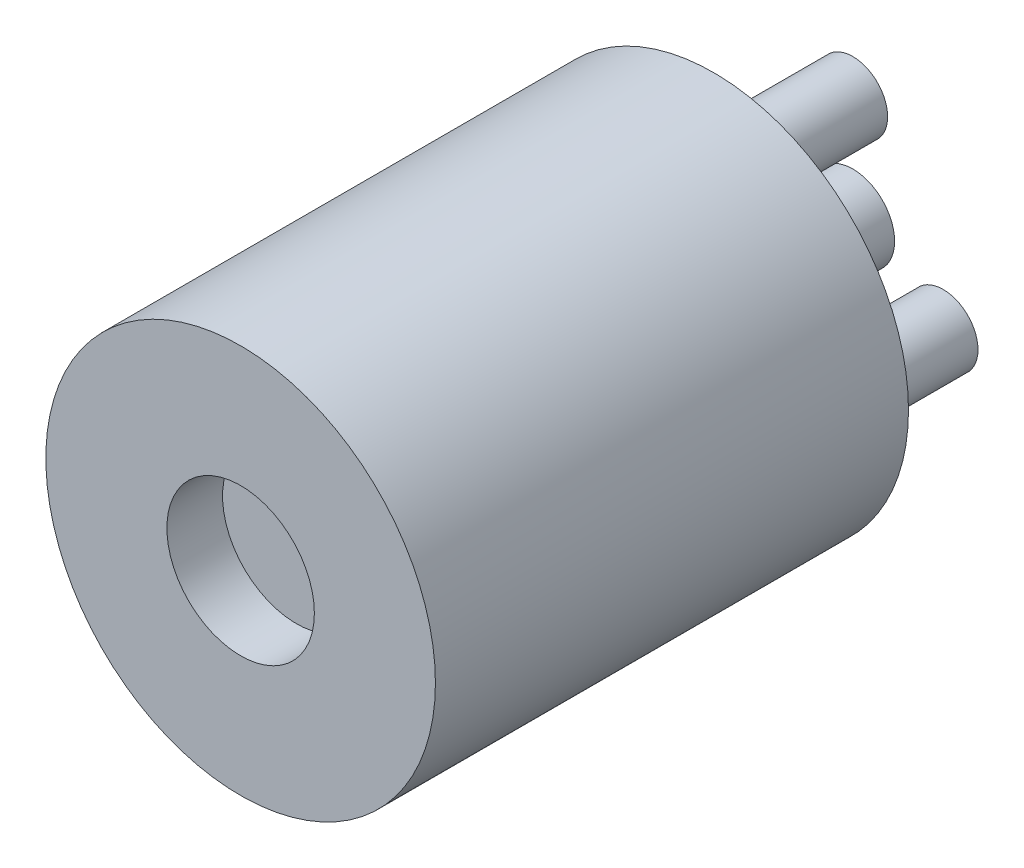
ISO-10303-21;
HEADER;
FILE_DESCRIPTION(('STEP AP214'),'2;1');
FILE_NAME('part.step','',(''),(''),'','','');
FILE_SCHEMA(('AUTOMOTIVE_DESIGN { 1 0 10303 214 1 1 1 1 }'));
ENDSEC;
DATA;
#1=APPLICATION_CONTEXT('core data for automotive mechanical design processes');
#2=APPLICATION_PROTOCOL_DEFINITION('international standard','automotive_design',2000,#1);
#3=PRODUCT_CONTEXT('',#1,'mechanical');
#4=PRODUCT('Part','Part','',(#3));
#5=PRODUCT_RELATED_PRODUCT_CATEGORY('part','',(#4));
#6=PRODUCT_DEFINITION_FORMATION('','',#4);
#7=PRODUCT_DEFINITION_CONTEXT('part definition',#1,'design');
#8=PRODUCT_DEFINITION('design','',#6,#7);
#9=PRODUCT_DEFINITION_SHAPE('','',#8);
#10=(LENGTH_UNIT() NAMED_UNIT(*) SI_UNIT(.MILLI.,.METRE.));
#11=(NAMED_UNIT(*) PLANE_ANGLE_UNIT() SI_UNIT($,.RADIAN.));
#12=(NAMED_UNIT(*) SI_UNIT($,.STERADIAN.) SOLID_ANGLE_UNIT());
#13=UNCERTAINTY_MEASURE_WITH_UNIT(LENGTH_MEASURE(1.E-05),#10,'distance_accuracy_value','');
#14=(GEOMETRIC_REPRESENTATION_CONTEXT(3) GLOBAL_UNCERTAINTY_ASSIGNED_CONTEXT((#13)) GLOBAL_UNIT_ASSIGNED_CONTEXT((#10,
#11,#12)) REPRESENTATION_CONTEXT('',''));
#15=CARTESIAN_POINT('',(0.,0.,0.));
#16=DIRECTION('',(0.,0.,1.));
#17=DIRECTION('',(1.,0.,0.));
#18=AXIS2_PLACEMENT_3D('',#15,#16,#17);
#19=CARTESIAN_POINT('',(-43.4831412322115,-69.9890520639301,17.));
#20=DIRECTION('',(0.,0.,1.));
#21=DIRECTION('',(1.,0.,0.));
#22=AXIS2_PLACEMENT_3D('',#19,#20,#21);
#23=PLANE('',#22);
#24=CARTESIAN_POINT('',(-43.4831412322115,-69.9890520639301,17.));
#25=DIRECTION('',(0.,0.,1.));
#26=DIRECTION('',(1.,0.,0.));
#27=AXIS2_PLACEMENT_3D('',#24,#25,#26);
#28=CIRCLE('',#27,2.65);
#29=CARTESIAN_POINT('',(-40.8331412322115,-69.9890520639301,17.));
#30=VERTEX_POINT('',#29);
#31=EDGE_CURVE('E58',#30,#30,#28,.T.);
#32=ORIENTED_EDGE('',*,*,#31,.F.);
#33=EDGE_LOOP('',(#32));
#34=FACE_BOUND('',#33,.T.);
#35=CARTESIAN_POINT('',(-43.4831412322115,-69.9890520639301,17.));
#36=DIRECTION('',(0.,0.,1.));
#37=DIRECTION('',(1.,0.,0.));
#38=AXIS2_PLACEMENT_3D('',#35,#36,#37);
#39=CIRCLE('',#38,6.9999999999992);
#40=CARTESIAN_POINT('',(-36.4831412322123,-69.9890520639301,17.));
#41=VERTEX_POINT('',#40);
#42=EDGE_CURVE('E45',#41,#41,#39,.T.);
#43=ORIENTED_EDGE('',*,*,#42,.T.);
#44=EDGE_LOOP('',(#43));
#45=FACE_BOUND('',#44,.T.);
#46=ADVANCED_FACE('F37',(#34,#45),#23,.T.);
#47=CARTESIAN_POINT('',(-43.4831412322115,-69.9890520639301,0.));
#48=DIRECTION('',(0.,0.,1.));
#49=DIRECTION('',(1.,0.,0.));
#50=AXIS2_PLACEMENT_3D('',#47,#48,#49);
#51=PLANE('',#50);
#52=CARTESIAN_POINT('',(-43.4831412322115,-69.9890520639301,0.));
#53=DIRECTION('',(0.,0.,1.));
#54=DIRECTION('',(1.,0.,0.));
#55=AXIS2_PLACEMENT_3D('',#52,#53,#54);
#56=CIRCLE('',#55,1.5);
#57=CARTESIAN_POINT('',(-41.9831412322115,-69.9890520639301,0.));
#58=VERTEX_POINT('',#57);
#59=EDGE_CURVE('E10',#58,#58,#56,.F.);
#60=ORIENTED_EDGE('',*,*,#59,.F.);
#61=EDGE_LOOP('',(#60));
#62=FACE_BOUND('',#61,.T.);
#63=CARTESIAN_POINT('',(-43.4831412322115,-69.9890520639301,0.));
#64=DIRECTION('',(0.,0.,1.));
#65=DIRECTION('',(1.,0.,0.));
#66=AXIS2_PLACEMENT_3D('',#63,#64,#65);
#67=CIRCLE('',#66,6.9999999999992);
#68=CARTESIAN_POINT('',(-36.4831412322123,-69.9890520639301,0.));
#69=VERTEX_POINT('',#68);
#70=EDGE_CURVE('E50',#69,#69,#67,.T.);
#71=ORIENTED_EDGE('',*,*,#70,.F.);
#72=EDGE_LOOP('',(#71));
#73=FACE_BOUND('',#72,.T.);
#74=CARTESIAN_POINT('',(-43.4831412322115,-66.2390520639304,0.));
#75=DIRECTION('',(0.,0.,1.));
#76=DIRECTION('',(1.,0.,0.));
#77=AXIS2_PLACEMENT_3D('',#74,#75,#76);
#78=CIRCLE('',#77,1.25);
#79=CARTESIAN_POINT('',(-42.2331412322115,-66.2390520639304,0.));
#80=VERTEX_POINT('',#79);
#81=EDGE_CURVE('E69',#80,#80,#78,.F.);
#82=ORIENTED_EDGE('',*,*,#81,.F.);
#83=EDGE_LOOP('',(#82));
#84=FACE_BOUND('',#83,.T.);
#85=CARTESIAN_POINT('',(-40.2355459680198,-71.8640520639283,0.));
#86=DIRECTION('',(0.,0.,1.));
#87=DIRECTION('',(1.,0.,0.));
#88=AXIS2_PLACEMENT_3D('',#85,#86,#87);
#89=CIRCLE('',#88,1.25);
#90=CARTESIAN_POINT('',(-38.9855459680198,-71.8640520639283,0.));
#91=VERTEX_POINT('',#90);
#92=EDGE_CURVE('E85',#91,#91,#89,.F.);
#93=ORIENTED_EDGE('',*,*,#92,.F.);
#94=EDGE_LOOP('',(#93));
#95=FACE_BOUND('',#94,.T.);
#96=CARTESIAN_POINT('',(-46.7307364964012,-71.8640520639294,0.));
#97=DIRECTION('',(0.,0.,1.));
#98=DIRECTION('',(1.,0.,0.));
#99=AXIS2_PLACEMENT_3D('',#96,#97,#98);
#100=CIRCLE('',#99,1.25);
#101=CARTESIAN_POINT('',(-45.4807364964012,-71.8640520639294,0.));
#102=VERTEX_POINT('',#101);
#103=EDGE_CURVE('E77',#102,#102,#100,.F.);
#104=ORIENTED_EDGE('',*,*,#103,.F.);
#105=EDGE_LOOP('',(#104));
#106=FACE_BOUND('',#105,.T.);
#107=ADVANCED_FACE('F102',(#62,#73,#84,#95,#106),#51,.F.);
#108=CARTESIAN_POINT('',(-43.4831412322115,-69.9890520639301,17.));
#109=DIRECTION('',(0.,0.,-1.));
#110=DIRECTION('',(-1.,0.,0.));
#111=AXIS2_PLACEMENT_3D('',#108,#109,#110);
#112=CYLINDRICAL_SURFACE('',#111,6.9999999999992);
#113=ORIENTED_EDGE('',*,*,#42,.F.);
#114=EDGE_LOOP('',(#113));
#115=FACE_BOUND('',#114,.T.);
#116=ORIENTED_EDGE('',*,*,#70,.T.);
#117=EDGE_LOOP('',(#116));
#118=FACE_BOUND('',#117,.T.);
#119=ADVANCED_FACE('F39',(#115,#118),#112,.T.);
#120=CARTESIAN_POINT('',(-43.4831412322115,-69.9890520639301,15.));
#121=DIRECTION('',(0.,0.,1.));
#122=DIRECTION('',(1.,0.,0.));
#123=AXIS2_PLACEMENT_3D('',#120,#121,#122);
#124=CYLINDRICAL_SURFACE('',#123,2.65);
#125=CARTESIAN_POINT('',(-43.4831412322115,-69.9890520639301,15.));
#126=DIRECTION('',(0.,0.,1.));
#127=DIRECTION('',(1.,0.,0.));
#128=AXIS2_PLACEMENT_3D('',#125,#126,#127);
#129=CIRCLE('',#128,2.65);
#130=CARTESIAN_POINT('',(-40.8331412322115,-69.9890520639301,15.));
#131=VERTEX_POINT('',#130);
#132=EDGE_CURVE('E56',#131,#131,#129,.T.);
#133=ORIENTED_EDGE('',*,*,#132,.F.);
#134=EDGE_LOOP('',(#133));
#135=FACE_BOUND('',#134,.T.);
#136=ORIENTED_EDGE('',*,*,#31,.T.);
#137=EDGE_LOOP('',(#136));
#138=FACE_BOUND('',#137,.T.);
#139=ADVANCED_FACE('F130',(#135,#138),#124,.F.);
#140=CARTESIAN_POINT('',(-43.4831412322115,-69.9890520639301,15.));
#141=DIRECTION('',(0.,0.,1.));
#142=DIRECTION('',(1.,0.,0.));
#143=AXIS2_PLACEMENT_3D('',#140,#141,#142);
#144=PLANE('',#143);
#145=ORIENTED_EDGE('',*,*,#132,.T.);
#146=EDGE_LOOP('',(#145));
#147=FACE_BOUND('',#146,.T.);
#148=ADVANCED_FACE('F133',(#147),#144,.T.);
#149=CARTESIAN_POINT('',(-43.4831412322115,-69.9890520639301,-5.));
#150=DIRECTION('',(0.,0.,1.));
#151=DIRECTION('',(1.,0.,0.));
#152=AXIS2_PLACEMENT_3D('',#149,#150,#151);
#153=CYLINDRICAL_SURFACE('',#152,1.5);
#154=CARTESIAN_POINT('',(-43.4831412322115,-69.9890520639301,-5.));
#155=DIRECTION('',(0.,0.,-1.));
#156=DIRECTION('',(-1.,0.,0.));
#157=AXIS2_PLACEMENT_3D('',#154,#155,#156);
#158=CIRCLE('',#157,1.5);
#159=CARTESIAN_POINT('',(-44.9831412322115,-69.9890520639301,-5.));
#160=VERTEX_POINT('',#159);
#161=EDGE_CURVE('E62',#160,#160,#158,.T.);
#162=ORIENTED_EDGE('',*,*,#161,.F.);
#163=EDGE_LOOP('',(#162));
#164=FACE_BOUND('',#163,.T.);
#165=ORIENTED_EDGE('',*,*,#59,.T.);
#166=EDGE_LOOP('',(#165));
#167=FACE_BOUND('',#166,.T.);
#168=ADVANCED_FACE('F137',(#164,#167),#153,.T.);
#169=CARTESIAN_POINT('',(-43.4831412322115,-69.9890520639301,-5.));
#170=DIRECTION('',(0.,0.,-1.));
#171=DIRECTION('',(-1.,0.,0.));
#172=AXIS2_PLACEMENT_3D('',#169,#170,#171);
#173=PLANE('',#172);
#174=ORIENTED_EDGE('',*,*,#161,.T.);
#175=EDGE_LOOP('',(#174));
#176=FACE_BOUND('',#175,.T.);
#177=ADVANCED_FACE('F141',(#176),#173,.T.);
#178=CARTESIAN_POINT('',(-43.4831412322115,-66.2390520639304,-5.));
#179=DIRECTION('',(0.,0.,-1.));
#180=DIRECTION('',(-1.,0.,0.));
#181=AXIS2_PLACEMENT_3D('',#178,#179,#180);
#182=PLANE('',#181);
#183=CARTESIAN_POINT('',(-43.4831412322115,-66.2390520639304,-5.));
#184=DIRECTION('',(0.,0.,-1.));
#185=DIRECTION('',(-1.,0.,0.));
#186=AXIS2_PLACEMENT_3D('',#183,#184,#185);
#187=CIRCLE('',#186,1.25);
#188=CARTESIAN_POINT('',(-44.7331412322115,-66.2390520639304,-5.));
#189=VERTEX_POINT('',#188);
#190=EDGE_CURVE('E73',#189,#189,#187,.T.);
#191=ORIENTED_EDGE('',*,*,#190,.T.);
#192=EDGE_LOOP('',(#191));
#193=FACE_BOUND('',#192,.T.);
#194=ADVANCED_FACE('F145',(#193),#182,.T.);
#195=CARTESIAN_POINT('',(-43.4831412322115,-66.2390520639304,-5.));
#196=DIRECTION('',(0.,0.,1.));
#197=DIRECTION('',(1.,0.,0.));
#198=AXIS2_PLACEMENT_3D('',#195,#196,#197);
#199=CYLINDRICAL_SURFACE('',#198,1.25);
#200=ORIENTED_EDGE('',*,*,#190,.F.);
#201=EDGE_LOOP('',(#200));
#202=FACE_BOUND('',#201,.T.);
#203=ORIENTED_EDGE('',*,*,#81,.T.);
#204=EDGE_LOOP('',(#203));
#205=FACE_BOUND('',#204,.T.);
#206=ADVANCED_FACE('F118',(#202,#205),#199,.T.);
#207=CARTESIAN_POINT('',(-46.7307364964012,-71.8640520639294,-5.));
#208=DIRECTION('',(0.,0.,-1.));
#209=DIRECTION('',(-1.,0.,0.));
#210=AXIS2_PLACEMENT_3D('',#207,#208,#209);
#211=PLANE('',#210);
#212=CARTESIAN_POINT('',(-46.7307364964012,-71.8640520639294,-5.));
#213=DIRECTION('',(0.,0.,-1.));
#214=DIRECTION('',(-1.,0.,0.));
#215=AXIS2_PLACEMENT_3D('',#212,#213,#214);
#216=CIRCLE('',#215,1.25);
#217=CARTESIAN_POINT('',(-47.9807364964012,-71.8640520639294,-5.));
#218=VERTEX_POINT('',#217);
#219=EDGE_CURVE('E81',#218,#218,#216,.T.);
#220=ORIENTED_EDGE('',*,*,#219,.T.);
#221=EDGE_LOOP('',(#220));
#222=FACE_BOUND('',#221,.T.);
#223=ADVANCED_FACE('F110',(#222),#211,.T.);
#224=CARTESIAN_POINT('',(-46.7307364964012,-71.8640520639294,-5.));
#225=DIRECTION('',(0.,0.,1.));
#226=DIRECTION('',(1.,0.,0.));
#227=AXIS2_PLACEMENT_3D('',#224,#225,#226);
#228=CYLINDRICAL_SURFACE('',#227,1.25);
#229=ORIENTED_EDGE('',*,*,#219,.F.);
#230=EDGE_LOOP('',(#229));
#231=FACE_BOUND('',#230,.T.);
#232=ORIENTED_EDGE('',*,*,#103,.T.);
#233=EDGE_LOOP('',(#232));
#234=FACE_BOUND('',#233,.T.);
#235=ADVANCED_FACE('F108',(#231,#234),#228,.T.);
#236=CARTESIAN_POINT('',(-40.2355459680198,-71.8640520639283,-5.));
#237=DIRECTION('',(0.,0.,-1.));
#238=DIRECTION('',(-1.,0.,0.));
#239=AXIS2_PLACEMENT_3D('',#236,#237,#238);
#240=PLANE('',#239);
#241=CARTESIAN_POINT('',(-40.2355459680198,-71.8640520639283,-5.));
#242=DIRECTION('',(0.,0.,-1.));
#243=DIRECTION('',(-1.,0.,0.));
#244=AXIS2_PLACEMENT_3D('',#241,#242,#243);
#245=CIRCLE('',#244,1.25);
#246=CARTESIAN_POINT('',(-41.4855459680198,-71.8640520639283,-5.));
#247=VERTEX_POINT('',#246);
#248=EDGE_CURVE('E89',#247,#247,#245,.T.);
#249=ORIENTED_EDGE('',*,*,#248,.T.);
#250=EDGE_LOOP('',(#249));
#251=FACE_BOUND('',#250,.T.);
#252=ADVANCED_FACE('F94',(#251),#240,.T.);
#253=CARTESIAN_POINT('',(-40.2355459680198,-71.8640520639283,-5.));
#254=DIRECTION('',(0.,0.,1.));
#255=DIRECTION('',(1.,0.,0.));
#256=AXIS2_PLACEMENT_3D('',#253,#254,#255);
#257=CYLINDRICAL_SURFACE('',#256,1.25);
#258=ORIENTED_EDGE('',*,*,#248,.F.);
#259=EDGE_LOOP('',(#258));
#260=FACE_BOUND('',#259,.T.);
#261=ORIENTED_EDGE('',*,*,#92,.T.);
#262=EDGE_LOOP('',(#261));
#263=FACE_BOUND('',#262,.T.);
#264=ADVANCED_FACE('F96',(#260,#263),#257,.T.);
#265=CLOSED_SHELL('',(#46,#107,#119,#139,#148,#168,#177,#194,#206,#223,#235,#252,#264));
#266=MANIFOLD_SOLID_BREP('B2',#265);
#267=ADVANCED_BREP_SHAPE_REPRESENTATION('',(#18,#266),#14);
#268=SHAPE_DEFINITION_REPRESENTATION(#9,#267);
ENDSEC;
END-ISO-10303-21;
